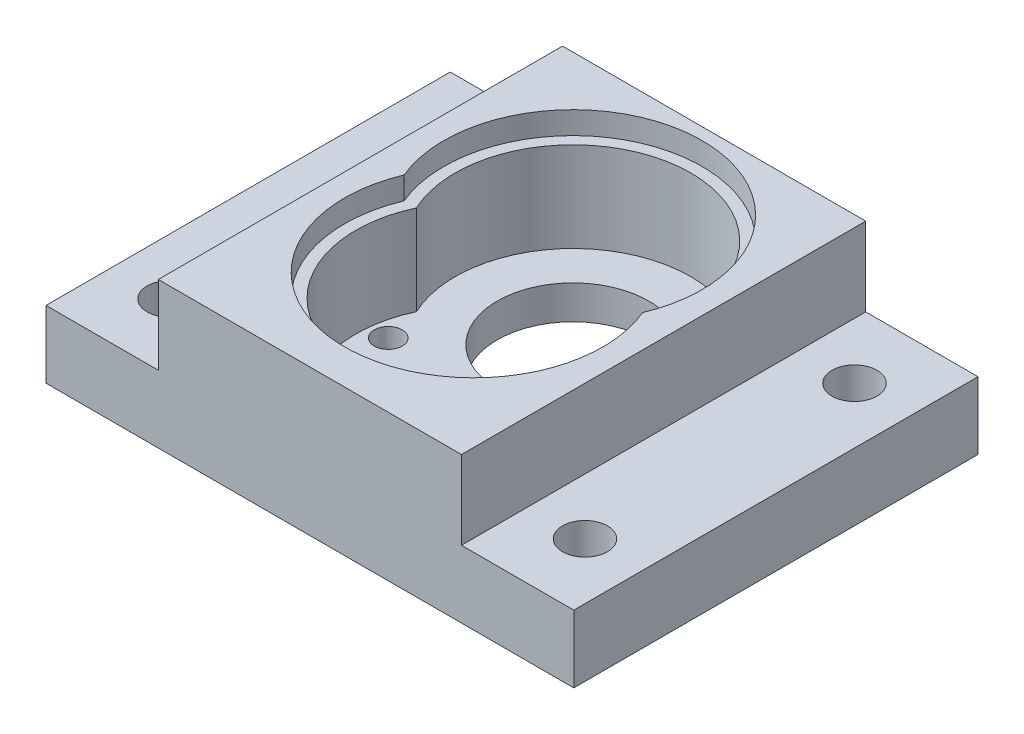
ISO-10303-21;
HEADER;
FILE_DESCRIPTION(('STEP AP214'),'2;1');
FILE_NAME('part.step','',(''),(''),'','','');
FILE_SCHEMA(('AUTOMOTIVE_DESIGN { 1 0 10303 214 1 1 1 1 }'));
ENDSEC;
DATA;
#1=APPLICATION_CONTEXT('core data for automotive mechanical design processes');
#2=APPLICATION_PROTOCOL_DEFINITION('international standard','automotive_design',2000,#1);
#3=PRODUCT_CONTEXT('',#1,'mechanical');
#4=PRODUCT('Part','Part','',(#3));
#5=PRODUCT_RELATED_PRODUCT_CATEGORY('part','',(#4));
#6=PRODUCT_DEFINITION_FORMATION('','',#4);
#7=PRODUCT_DEFINITION_CONTEXT('part definition',#1,'design');
#8=PRODUCT_DEFINITION('design','',#6,#7);
#9=PRODUCT_DEFINITION_SHAPE('','',#8);
#10=(LENGTH_UNIT() NAMED_UNIT(*) SI_UNIT(.MILLI.,.METRE.));
#11=(NAMED_UNIT(*) PLANE_ANGLE_UNIT() SI_UNIT($,.RADIAN.));
#12=(NAMED_UNIT(*) SI_UNIT($,.STERADIAN.) SOLID_ANGLE_UNIT());
#13=UNCERTAINTY_MEASURE_WITH_UNIT(LENGTH_MEASURE(1.E-05),#10,'distance_accuracy_value','');
#14=(GEOMETRIC_REPRESENTATION_CONTEXT(3) GLOBAL_UNCERTAINTY_ASSIGNED_CONTEXT((#13)) GLOBAL_UNIT_ASSIGNED_CONTEXT((#10,
#11,#12)) REPRESENTATION_CONTEXT('',''));
#15=CARTESIAN_POINT('',(0.,0.,0.));
#16=DIRECTION('',(0.,0.,1.));
#17=DIRECTION('',(1.,0.,0.));
#18=AXIS2_PLACEMENT_3D('',#15,#16,#17);
#19=CARTESIAN_POINT('',(-2.7,3.,10.7322998817629));
#20=DIRECTION('',(0.,-1.,0.));
#21=DIRECTION('',(0.,0.,-1.));
#22=AXIS2_PLACEMENT_3D('',#19,#20,#21);
#23=CYLINDRICAL_SURFACE('',#22,1.49999999999999);
#24=CARTESIAN_POINT('',(-2.7,0.,10.7322998817629));
#25=DIRECTION('',(0.,1.,0.));
#26=DIRECTION('',(0.,0.,-1.));
#27=AXIS2_PLACEMENT_3D('',#24,#25,#26);
#28=CIRCLE('',#27,1.49999999999999);
#29=CARTESIAN_POINT('',(-2.7,0.,9.2322998817629));
#30=VERTEX_POINT('',#29);
#31=EDGE_CURVE('E294',#30,#30,#28,.T.);
#32=ORIENTED_EDGE('',*,*,#31,.F.);
#33=EDGE_LOOP('',(#32));
#34=FACE_BOUND('',#33,.T.);
#35=DIRECTION('',(0.,-1.,0.));
#36=VECTOR('',#35,1.);
#37=CARTESIAN_POINT('',(-4.1997041539879,13.,10.7620899893726));
#38=LINE('',#37,#36);
#39=CARTESIAN_POINT('',(-4.1997041539879,11.,10.7620899893726));
#40=VERTEX_POINT('',#39);
#41=CARTESIAN_POINT('',(-4.1997041539879,3.,10.7620899893726));
#42=VERTEX_POINT('',#41);
#43=EDGE_CURVE('E218',#40,#42,#38,.T.);
#44=ORIENTED_EDGE('',*,*,#43,.F.);
#45=CARTESIAN_POINT('',(-2.7,11.,10.7322998817629));
#46=DIRECTION('',(0.,1.,0.));
#47=DIRECTION('',(0.,0.,1.));
#48=AXIS2_PLACEMENT_3D('',#45,#46,#47);
#49=CIRCLE('',#48,1.49999999999999);
#50=CARTESIAN_POINT('',(-1.4359648281927,11.,11.5398982252692));
#51=VERTEX_POINT('',#50);
#52=EDGE_CURVE('E179',#40,#51,#49,.T.);
#53=ORIENTED_EDGE('',*,*,#52,.T.);
#54=DIRECTION('',(0.,-1.,0.));
#55=VECTOR('',#54,1.);
#56=CARTESIAN_POINT('',(-1.4359648281927,13.,11.5398982252692));
#57=LINE('',#56,#55);
#58=CARTESIAN_POINT('',(-1.4359648281927,3.,11.5398982252692));
#59=VERTEX_POINT('',#58);
#60=EDGE_CURVE('E220',#51,#59,#57,.T.);
#61=ORIENTED_EDGE('',*,*,#60,.T.);
#62=CARTESIAN_POINT('',(-2.7,3.,10.7322998817629));
#63=DIRECTION('',(0.,1.,0.));
#64=DIRECTION('',(0.,0.,-1.));
#65=AXIS2_PLACEMENT_3D('',#62,#63,#64);
#66=CIRCLE('',#65,1.49999999999999);
#67=EDGE_CURVE('E297',#59,#42,#66,.T.);
#68=ORIENTED_EDGE('',*,*,#67,.T.);
#69=EDGE_LOOP('',(#44,#53,#61,#68));
#70=FACE_BOUND('',#69,.T.);
#71=ADVANCED_FACE('F38',(#34,#70),#23,.F.);
#72=CARTESIAN_POINT('',(2.7,3.,10.7322998817629));
#73=DIRECTION('',(0.,-1.,0.));
#74=DIRECTION('',(0.,0.,-1.));
#75=AXIS2_PLACEMENT_3D('',#72,#73,#74);
#76=CYLINDRICAL_SURFACE('',#75,1.49999999999999);
#77=CARTESIAN_POINT('',(2.7,0.,10.7322998817629));
#78=DIRECTION('',(0.,1.,0.));
#79=DIRECTION('',(0.,0.,1.));
#80=AXIS2_PLACEMENT_3D('',#77,#78,#79);
#81=CIRCLE('',#80,1.49999999999999);
#82=CARTESIAN_POINT('',(2.7,0.,12.2322998817629));
#83=VERTEX_POINT('',#82);
#84=EDGE_CURVE('E279',#83,#83,#81,.T.);
#85=ORIENTED_EDGE('',*,*,#84,.F.);
#86=EDGE_LOOP('',(#85));
#87=FACE_BOUND('',#86,.T.);
#88=DIRECTION('',(0.,-1.,0.));
#89=VECTOR('',#88,1.);
#90=CARTESIAN_POINT('',(1.43596482819271,13.,11.5398982252692));
#91=LINE('',#90,#89);
#92=CARTESIAN_POINT('',(1.43596482819271,11.,11.5398982252692));
#93=VERTEX_POINT('',#92);
#94=CARTESIAN_POINT('',(1.43596482819271,3.,11.5398982252692));
#95=VERTEX_POINT('',#94);
#96=EDGE_CURVE('E222',#93,#95,#91,.T.);
#97=ORIENTED_EDGE('',*,*,#96,.F.);
#98=CARTESIAN_POINT('',(2.7,11.,10.7322998817629));
#99=DIRECTION('',(0.,1.,0.));
#100=DIRECTION('',(0.,0.,1.));
#101=AXIS2_PLACEMENT_3D('',#98,#99,#100);
#102=CIRCLE('',#101,1.49999999999999);
#103=CARTESIAN_POINT('',(4.19970415398791,11.,10.7620899893726));
#104=VERTEX_POINT('',#103);
#105=EDGE_CURVE('E176',#93,#104,#102,.T.);
#106=ORIENTED_EDGE('',*,*,#105,.T.);
#107=DIRECTION('',(0.,-1.,0.));
#108=VECTOR('',#107,1.);
#109=CARTESIAN_POINT('',(4.19970415398791,13.,10.7620899893726));
#110=LINE('',#109,#108);
#111=CARTESIAN_POINT('',(4.19970415398791,3.,10.7620899893726));
#112=VERTEX_POINT('',#111);
#113=EDGE_CURVE('E206',#104,#112,#110,.T.);
#114=ORIENTED_EDGE('',*,*,#113,.T.);
#115=CARTESIAN_POINT('',(2.7,3.,10.7322998817629));
#116=DIRECTION('',(0.,1.,0.));
#117=DIRECTION('',(0.,0.,1.));
#118=AXIS2_PLACEMENT_3D('',#115,#116,#117);
#119=CIRCLE('',#118,1.49999999999999);
#120=EDGE_CURVE('E282',#112,#95,#119,.T.);
#121=ORIENTED_EDGE('',*,*,#120,.T.);
#122=EDGE_LOOP('',(#97,#106,#114,#121));
#123=FACE_BOUND('',#122,.T.);
#124=ADVANCED_FACE('F365',(#87,#123),#76,.F.);
#125=CARTESIAN_POINT('',(0.,13.,1.13855191759373));
#126=DIRECTION('',(0.,-1.,0.));
#127=DIRECTION('',(0.,0.,-1.));
#128=AXIS2_PLACEMENT_3D('',#125,#126,#127);
#129=CYLINDRICAL_SURFACE('',#128,10.5);
#130=ORIENTED_EDGE('',*,*,#113,.F.);
#131=CARTESIAN_POINT('',(0.,11.,1.13855191759373));
#132=DIRECTION('',(0.,1.,0.));
#133=DIRECTION('',(0.,0.,1.));
#134=AXIS2_PLACEMENT_3D('',#131,#132,#133);
#135=CIRCLE('',#134,10.5);
#136=CARTESIAN_POINT('',(9.52470471983253,11.,-3.28072404120314));
#137=VERTEX_POINT('',#136);
#138=EDGE_CURVE('E173',#104,#137,#135,.T.);
#139=ORIENTED_EDGE('',*,*,#138,.T.);
#140=DIRECTION('',(0.,-1.,0.));
#141=VECTOR('',#140,1.);
#142=CARTESIAN_POINT('',(9.52470471983253,13.,-3.28072404120314));
#143=LINE('',#142,#141);
#144=CARTESIAN_POINT('',(9.52470471983253,3.,-3.28072404120314));
#145=VERTEX_POINT('',#144);
#146=EDGE_CURVE('E196',#137,#145,#143,.T.);
#147=ORIENTED_EDGE('',*,*,#146,.T.);
#148=CARTESIAN_POINT('',(0.,3.,1.13855191759373));
#149=DIRECTION('',(0.,1.,0.));
#150=DIRECTION('',(0.,0.,1.));
#151=AXIS2_PLACEMENT_3D('',#148,#149,#150);
#152=CIRCLE('',#151,10.5);
#153=EDGE_CURVE('E185',#112,#145,#152,.T.);
#154=ORIENTED_EDGE('',*,*,#153,.F.);
#155=EDGE_LOOP('',(#130,#139,#147,#154));
#156=FACE_BOUND('',#155,.T.);
#157=ADVANCED_FACE('F371',(#156),#129,.F.);
#158=ORIENTED_EDGE('',*,*,#60,.F.);
#159=CARTESIAN_POINT('',(0.,11.,1.13855191759373));
#160=DIRECTION('',(0.,1.,0.));
#161=DIRECTION('',(0.,0.,1.));
#162=AXIS2_PLACEMENT_3D('',#159,#160,#161);
#163=CIRCLE('',#162,10.5);
#164=EDGE_CURVE('E182',#51,#93,#163,.T.);
#165=ORIENTED_EDGE('',*,*,#164,.T.);
#166=ORIENTED_EDGE('',*,*,#96,.T.);
#167=EDGE_CURVE('E199',#59,#95,#152,.T.);
#168=ORIENTED_EDGE('',*,*,#167,.F.);
#169=EDGE_LOOP('',(#158,#165,#166,#168));
#170=FACE_BOUND('',#169,.T.);
#171=ADVANCED_FACE('F496',(#170),#129,.F.);
#172=DIRECTION('',(0.,-1.,0.));
#173=VECTOR('',#172,1.);
#174=CARTESIAN_POINT('',(-9.52470471983253,13.,-3.28072404120314));
#175=LINE('',#174,#173);
#176=CARTESIAN_POINT('',(-9.52470471983253,11.,-3.28072404120314));
#177=VERTEX_POINT('',#176);
#178=CARTESIAN_POINT('',(-9.52470471983253,3.,-3.28072404120314));
#179=VERTEX_POINT('',#178);
#180=EDGE_CURVE('E216',#177,#179,#175,.T.);
#181=ORIENTED_EDGE('',*,*,#180,.F.);
#182=CARTESIAN_POINT('',(0.,11.,1.13855191759373));
#183=DIRECTION('',(0.,1.,0.));
#184=DIRECTION('',(0.,0.,1.));
#185=AXIS2_PLACEMENT_3D('',#182,#183,#184);
#186=CIRCLE('',#185,10.5);
#187=EDGE_CURVE('E53',#177,#40,#186,.T.);
#188=ORIENTED_EDGE('',*,*,#187,.T.);
#189=ORIENTED_EDGE('',*,*,#43,.T.);
#190=EDGE_CURVE('E200',#179,#42,#152,.T.);
#191=ORIENTED_EDGE('',*,*,#190,.F.);
#192=EDGE_LOOP('',(#181,#188,#189,#191));
#193=FACE_BOUND('',#192,.T.);
#194=ADVANCED_FACE('F493',(#193),#129,.F.);
#195=CARTESIAN_POINT('',(0.,13.,-7.7));
#196=DIRECTION('',(0.,-1.,0.));
#197=DIRECTION('',(0.,0.,-1.));
#198=AXIS2_PLACEMENT_3D('',#195,#196,#197);
#199=CYLINDRICAL_SURFACE('',#198,10.5);
#200=ORIENTED_EDGE('',*,*,#146,.F.);
#201=CARTESIAN_POINT('',(0.,11.,-7.7));
#202=DIRECTION('',(0.,1.,0.));
#203=DIRECTION('',(0.,0.,1.));
#204=AXIS2_PLACEMENT_3D('',#201,#202,#203);
#205=CIRCLE('',#204,10.5);
#206=EDGE_CURVE('E11',#137,#177,#205,.T.);
#207=ORIENTED_EDGE('',*,*,#206,.T.);
#208=ORIENTED_EDGE('',*,*,#180,.T.);
#209=CARTESIAN_POINT('',(0.,3.,-7.7));
#210=DIRECTION('',(0.,1.,0.));
#211=DIRECTION('',(0.,0.,1.));
#212=AXIS2_PLACEMENT_3D('',#209,#210,#211);
#213=CIRCLE('',#212,10.5);
#214=EDGE_CURVE('E190',#145,#179,#213,.T.);
#215=ORIENTED_EDGE('',*,*,#214,.F.);
#216=EDGE_LOOP('',(#200,#207,#208,#215));
#217=FACE_BOUND('',#216,.T.);
#218=ADVANCED_FACE('F490',(#217),#199,.F.);
#219=CARTESIAN_POINT('',(8.75,3.,0.));
#220=DIRECTION('',(0.,-1.,0.));
#221=DIRECTION('',(0.,0.,-1.));
#222=AXIS2_PLACEMENT_3D('',#219,#220,#221);
#223=CYLINDRICAL_SURFACE('',#222,1.25);
#224=CARTESIAN_POINT('',(8.75,3.,0.));
#225=DIRECTION('',(0.,1.,0.));
#226=DIRECTION('',(0.,0.,1.));
#227=AXIS2_PLACEMENT_3D('',#224,#225,#226);
#228=CIRCLE('',#227,1.25);
#229=CARTESIAN_POINT('',(8.75,3.,1.25));
#230=VERTEX_POINT('',#229);
#231=EDGE_CURVE('E285',#230,#230,#228,.T.);
#232=ORIENTED_EDGE('',*,*,#231,.T.);
#233=EDGE_LOOP('',(#232));
#234=FACE_BOUND('',#233,.T.);
#235=CARTESIAN_POINT('',(8.75,1.,0.));
#236=DIRECTION('',(0.,-1.,0.));
#237=DIRECTION('',(0.,0.,-1.));
#238=AXIS2_PLACEMENT_3D('',#235,#236,#237);
#239=CIRCLE('',#238,1.25);
#240=CARTESIAN_POINT('',(8.75,1.,-1.25));
#241=VERTEX_POINT('',#240);
#242=EDGE_CURVE('E228',#241,#241,#239,.T.);
#243=ORIENTED_EDGE('',*,*,#242,.T.);
#244=EDGE_LOOP('',(#243));
#245=FACE_BOUND('',#244,.T.);
#246=ADVANCED_FACE('F312',(#234,#245),#223,.F.);
#247=CARTESIAN_POINT('',(-8.75,3.,0.));
#248=DIRECTION('',(0.,-1.,0.));
#249=DIRECTION('',(0.,0.,-1.));
#250=AXIS2_PLACEMENT_3D('',#247,#248,#249);
#251=CYLINDRICAL_SURFACE('',#250,1.25000000000004);
#252=CARTESIAN_POINT('',(-8.75,3.,0.));
#253=DIRECTION('',(0.,1.,0.));
#254=DIRECTION('',(0.,0.,-1.));
#255=AXIS2_PLACEMENT_3D('',#252,#253,#254);
#256=CIRCLE('',#255,1.25000000000004);
#257=CARTESIAN_POINT('',(-8.75,3.,-1.25000000000004));
#258=VERTEX_POINT('',#257);
#259=EDGE_CURVE('E300',#258,#258,#256,.T.);
#260=ORIENTED_EDGE('',*,*,#259,.T.);
#261=EDGE_LOOP('',(#260));
#262=FACE_BOUND('',#261,.T.);
#263=CARTESIAN_POINT('',(-8.75,1.,0.));
#264=DIRECTION('',(0.,-1.,0.));
#265=DIRECTION('',(0.,0.,-1.));
#266=AXIS2_PLACEMENT_3D('',#263,#264,#265);
#267=CIRCLE('',#266,1.25000000000004);
#268=CARTESIAN_POINT('',(-8.75,1.,-1.25000000000004));
#269=VERTEX_POINT('',#268);
#270=EDGE_CURVE('E234',#269,#269,#267,.T.);
#271=ORIENTED_EDGE('',*,*,#270,.T.);
#272=EDGE_LOOP('',(#271));
#273=FACE_BOUND('',#272,.T.);
#274=ADVANCED_FACE('F376',(#262,#273),#251,.F.);
#275=CARTESIAN_POINT('',(0.,3.,0.));
#276=DIRECTION('',(0.,-1.,0.));
#277=DIRECTION('',(0.,0.,-1.));
#278=AXIS2_PLACEMENT_3D('',#275,#276,#277);
#279=PLANE('',#278);
#280=ORIENTED_EDGE('',*,*,#67,.F.);
#281=ORIENTED_EDGE('',*,*,#167,.T.);
#282=ORIENTED_EDGE('',*,*,#120,.F.);
#283=ORIENTED_EDGE('',*,*,#153,.T.);
#284=ORIENTED_EDGE('',*,*,#214,.T.);
#285=ORIENTED_EDGE('',*,*,#190,.T.);
#286=EDGE_LOOP('',(#280,#281,#282,#283,#284,#285));
#287=FACE_BOUND('',#286,.T.);
#288=CARTESIAN_POINT('',(0.,3.,-7.7));
#289=DIRECTION('',(0.,1.,0.));
#290=DIRECTION('',(0.,0.,1.));
#291=AXIS2_PLACEMENT_3D('',#288,#289,#290);
#292=CIRCLE('',#291,6.75);
#293=CARTESIAN_POINT('',(0.,3.,-0.950000000000003));
#294=VERTEX_POINT('',#293);
#295=EDGE_CURVE('E291',#294,#294,#292,.T.);
#296=ORIENTED_EDGE('',*,*,#295,.F.);
#297=EDGE_LOOP('',(#296));
#298=FACE_BOUND('',#297,.T.);
#299=ORIENTED_EDGE('',*,*,#259,.F.);
#300=EDGE_LOOP('',(#299));
#301=FACE_BOUND('',#300,.T.);
#302=ORIENTED_EDGE('',*,*,#231,.F.);
#303=EDGE_LOOP('',(#302));
#304=FACE_BOUND('',#303,.T.);
#305=CARTESIAN_POINT('',(0.,3.,4.3));
#306=DIRECTION('',(0.,1.,0.));
#307=DIRECTION('',(0.,0.,1.));
#308=AXIS2_PLACEMENT_3D('',#305,#306,#307);
#309=CIRCLE('',#308,1.5);
#310=CARTESIAN_POINT('',(0.,3.,5.8));
#311=VERTEX_POINT('',#310);
#312=EDGE_CURVE('E276',#311,#311,#309,.T.);
#313=ORIENTED_EDGE('',*,*,#312,.F.);
#314=EDGE_LOOP('',(#313));
#315=FACE_BOUND('',#314,.T.);
#316=ADVANCED_FACE('F331',(#287,#298,#301,#304,#315),#279,.F.);
#317=CARTESIAN_POINT('',(0.,0.,0.));
#318=DIRECTION('',(0.,-1.,0.));
#319=DIRECTION('',(0.,0.,-1.));
#320=AXIS2_PLACEMENT_3D('',#317,#318,#319);
#321=PLANE('',#320);
#322=CARTESIAN_POINT('',(18.5,0.,-14.2677001182371));
#323=DIRECTION('',(0.,-1.,0.));
#324=DIRECTION('',(0.,0.,-1.));
#325=AXIS2_PLACEMENT_3D('',#322,#323,#324);
#326=CIRCLE('',#325,2.);
#327=CARTESIAN_POINT('',(18.5,0.,-16.2677001182371));
#328=VERTEX_POINT('',#327);
#329=EDGE_CURVE('E442',#328,#328,#326,.T.);
#330=ORIENTED_EDGE('',*,*,#329,.F.);
#331=EDGE_LOOP('',(#330));
#332=FACE_BOUND('',#331,.T.);
#333=CARTESIAN_POINT('',(18.5,0.,9.7322998817629));
#334=DIRECTION('',(0.,-1.,0.));
#335=DIRECTION('',(0.,0.,-1.));
#336=AXIS2_PLACEMENT_3D('',#333,#334,#335);
#337=CIRCLE('',#336,2.);
#338=CARTESIAN_POINT('',(18.5,0.,7.7322998817629));
#339=VERTEX_POINT('',#338);
#340=EDGE_CURVE('E441',#339,#339,#337,.T.);
#341=ORIENTED_EDGE('',*,*,#340,.F.);
#342=EDGE_LOOP('',(#341));
#343=FACE_BOUND('',#342,.T.);
#344=CARTESIAN_POINT('',(-18.5,0.,9.7322998817629));
#345=DIRECTION('',(0.,-1.,0.));
#346=DIRECTION('',(0.,0.,-1.));
#347=AXIS2_PLACEMENT_3D('',#344,#345,#346);
#348=CIRCLE('',#347,2.);
#349=CARTESIAN_POINT('',(-18.5,0.,7.7322998817629));
#350=VERTEX_POINT('',#349);
#351=EDGE_CURVE('E453',#350,#350,#348,.T.);
#352=ORIENTED_EDGE('',*,*,#351,.F.);
#353=EDGE_LOOP('',(#352));
#354=FACE_BOUND('',#353,.T.);
#355=CARTESIAN_POINT('',(-18.5,0.,-14.2677001182371));
#356=DIRECTION('',(0.,-1.,0.));
#357=DIRECTION('',(0.,0.,-1.));
#358=AXIS2_PLACEMENT_3D('',#355,#356,#357);
#359=CIRCLE('',#358,2.);
#360=CARTESIAN_POINT('',(-18.5,0.,-16.2677001182371));
#361=VERTEX_POINT('',#360);
#362=EDGE_CURVE('E169',#361,#361,#359,.T.);
#363=ORIENTED_EDGE('',*,*,#362,.F.);
#364=EDGE_LOOP('',(#363));
#365=FACE_BOUND('',#364,.T.);
#366=CARTESIAN_POINT('',(8.75,0.,0.));
#367=DIRECTION('',(0.,-1.,0.));
#368=DIRECTION('',(0.,0.,-1.));
#369=AXIS2_PLACEMENT_3D('',#366,#367,#368);
#370=CIRCLE('',#369,3.);
#371=CARTESIAN_POINT('',(8.75,0.,-3.));
#372=VERTEX_POINT('',#371);
#373=EDGE_CURVE('E214',#372,#372,#370,.T.);
#374=ORIENTED_EDGE('',*,*,#373,.F.);
#375=EDGE_LOOP('',(#374));
#376=FACE_BOUND('',#375,.T.);
#377=CARTESIAN_POINT('',(-8.75,0.,0.));
#378=DIRECTION('',(0.,-1.,0.));
#379=DIRECTION('',(0.,0.,-1.));
#380=AXIS2_PLACEMENT_3D('',#377,#378,#379);
#381=CIRCLE('',#380,3.);
#382=CARTESIAN_POINT('',(-8.75,0.,-3.));
#383=VERTEX_POINT('',#382);
#384=EDGE_CURVE('E235',#383,#383,#381,.T.);
#385=ORIENTED_EDGE('',*,*,#384,.F.);
#386=EDGE_LOOP('',(#385));
#387=FACE_BOUND('',#386,.T.);
#388=ORIENTED_EDGE('',*,*,#84,.T.);
#389=EDGE_LOOP('',(#388));
#390=FACE_BOUND('',#389,.T.);
#391=CARTESIAN_POINT('',(0.,0.,-7.7));
#392=DIRECTION('',(0.,1.,0.));
#393=DIRECTION('',(0.,0.,1.));
#394=AXIS2_PLACEMENT_3D('',#391,#392,#393);
#395=CIRCLE('',#394,6.75);
#396=CARTESIAN_POINT('',(0.,0.,-0.950000000000003));
#397=VERTEX_POINT('',#396);
#398=EDGE_CURVE('E290',#397,#397,#395,.T.);
#399=ORIENTED_EDGE('',*,*,#398,.T.);
#400=EDGE_LOOP('',(#399));
#401=FACE_BOUND('',#400,.T.);
#402=DIRECTION('',(-1.,0.,0.));
#403=VECTOR('',#402,1.);
#404=CARTESIAN_POINT('',(-13.5,0.,-20.2677001182371));
#405=LINE('',#404,#403);
#406=CARTESIAN_POINT('',(23.5,0.,-20.2677001182371));
#407=VERTEX_POINT('',#406);
#408=CARTESIAN_POINT('',(-23.5,0.,-20.2677001182371));
#409=VERTEX_POINT('',#408);
#410=EDGE_CURVE('E305',#407,#409,#405,.T.);
#411=ORIENTED_EDGE('',*,*,#410,.F.);
#412=DIRECTION('',(0.,0.,-1.));
#413=VECTOR('',#412,1.);
#414=CARTESIAN_POINT('',(23.5,0.,27.3942036714535));
#415=LINE('',#414,#413);
#416=CARTESIAN_POINT('',(23.5,0.,15.7322998817629));
#417=VERTEX_POINT('',#416);
#418=EDGE_CURVE('E261',#417,#407,#415,.T.);
#419=ORIENTED_EDGE('',*,*,#418,.F.);
#420=DIRECTION('',(1.,0.,0.));
#421=VECTOR('',#420,1.);
#422=CARTESIAN_POINT('',(-13.5,0.,15.7322998817629));
#423=LINE('',#422,#421);
#424=CARTESIAN_POINT('',(-23.5,0.,15.7322998817629));
#425=VERTEX_POINT('',#424);
#426=EDGE_CURVE('E46',#425,#417,#423,.T.);
#427=ORIENTED_EDGE('',*,*,#426,.F.);
#428=DIRECTION('',(0.,0.,-1.));
#429=VECTOR('',#428,1.);
#430=CARTESIAN_POINT('',(-23.5,0.,27.3942036714535));
#431=LINE('',#430,#429);
#432=EDGE_CURVE('E251',#425,#409,#431,.T.);
#433=ORIENTED_EDGE('',*,*,#432,.T.);
#434=EDGE_LOOP('',(#411,#419,#427,#433));
#435=FACE_BOUND('',#434,.T.);
#436=ORIENTED_EDGE('',*,*,#31,.T.);
#437=EDGE_LOOP('',(#436));
#438=FACE_BOUND('',#437,.T.);
#439=CARTESIAN_POINT('',(0.,0.,4.3));
#440=DIRECTION('',(0.,1.,0.));
#441=DIRECTION('',(0.,0.,1.));
#442=AXIS2_PLACEMENT_3D('',#439,#440,#441);
#443=CIRCLE('',#442,1.5);
#444=CARTESIAN_POINT('',(0.,0.,5.8));
#445=VERTEX_POINT('',#444);
#446=EDGE_CURVE('E275',#445,#445,#443,.T.);
#447=ORIENTED_EDGE('',*,*,#446,.T.);
#448=EDGE_LOOP('',(#447));
#449=FACE_BOUND('',#448,.T.);
#450=ADVANCED_FACE('F328',(#332,#343,#354,#365,#376,#387,#390,#401,#435,#438,#449),#321,.T.);
#451=CARTESIAN_POINT('',(-13.5,3.,-20.2677001182371));
#452=DIRECTION('',(0.,0.,1.));
#453=DIRECTION('',(1.,0.,0.));
#454=AXIS2_PLACEMENT_3D('',#451,#452,#453);
#455=PLANE('',#454);
#456=DIRECTION('',(0.,-1.,0.));
#457=VECTOR('',#456,1.);
#458=CARTESIAN_POINT('',(13.5,13.,-20.2677001182371));
#459=LINE('',#458,#457);
#460=CARTESIAN_POINT('',(13.5,13.,-20.2677001182371));
#461=VERTEX_POINT('',#460);
#462=CARTESIAN_POINT('',(13.5,6.,-20.2677001182371));
#463=VERTEX_POINT('',#462);
#464=EDGE_CURVE('E211',#461,#463,#459,.T.);
#465=ORIENTED_EDGE('',*,*,#464,.T.);
#466=DIRECTION('',(1.,0.,0.));
#467=VECTOR('',#466,1.);
#468=CARTESIAN_POINT('',(13.5,6.,-20.2677001182371));
#469=LINE('',#468,#467);
#470=CARTESIAN_POINT('',(23.5,6.,-20.2677001182371));
#471=VERTEX_POINT('',#470);
#472=EDGE_CURVE('E244',#463,#471,#469,.T.);
#473=ORIENTED_EDGE('',*,*,#472,.T.);
#474=DIRECTION('',(0.,-1.,0.));
#475=VECTOR('',#474,1.);
#476=CARTESIAN_POINT('',(23.5,0.,-20.2677001182371));
#477=LINE('',#476,#475);
#478=EDGE_CURVE('E264',#471,#407,#477,.T.);
#479=ORIENTED_EDGE('',*,*,#478,.T.);
#480=ORIENTED_EDGE('',*,*,#410,.T.);
#481=DIRECTION('',(0.,1.,0.));
#482=VECTOR('',#481,1.);
#483=CARTESIAN_POINT('',(-23.5,0.,-20.2677001182371));
#484=LINE('',#483,#482);
#485=CARTESIAN_POINT('',(-23.5,6.,-20.2677001182371));
#486=VERTEX_POINT('',#485);
#487=EDGE_CURVE('E245',#409,#486,#484,.T.);
#488=ORIENTED_EDGE('',*,*,#487,.T.);
#489=DIRECTION('',(1.,0.,0.));
#490=VECTOR('',#489,1.);
#491=CARTESIAN_POINT('',(-13.5,6.,-20.2677001182371));
#492=LINE('',#491,#490);
#493=CARTESIAN_POINT('',(-13.5,6.,-20.2677001182371));
#494=VERTEX_POINT('',#493);
#495=EDGE_CURVE('E248',#486,#494,#492,.T.);
#496=ORIENTED_EDGE('',*,*,#495,.T.);
#497=DIRECTION('',(0.,-1.,0.));
#498=VECTOR('',#497,1.);
#499=CARTESIAN_POINT('',(-13.5,13.,-20.2677001182371));
#500=LINE('',#499,#498);
#501=CARTESIAN_POINT('',(-13.5,13.,-20.2677001182371));
#502=VERTEX_POINT('',#501);
#503=EDGE_CURVE('E209',#502,#494,#500,.T.);
#504=ORIENTED_EDGE('',*,*,#503,.F.);
#505=DIRECTION('',(-1.,0.,0.));
#506=VECTOR('',#505,1.);
#507=CARTESIAN_POINT('',(0.,13.,-20.2677001182371));
#508=LINE('',#507,#506);
#509=EDGE_CURVE('E189',#461,#502,#508,.T.);
#510=ORIENTED_EDGE('',*,*,#509,.F.);
#511=EDGE_LOOP('',(#465,#473,#479,#480,#488,#496,#504,#510));
#512=FACE_BOUND('',#511,.T.);
#513=ADVANCED_FACE('F40',(#512),#455,.F.);
#514=CARTESIAN_POINT('',(-13.5,3.,15.7322998817629));
#515=DIRECTION('',(0.,0.,-1.));
#516=DIRECTION('',(-1.,0.,0.));
#517=AXIS2_PLACEMENT_3D('',#514,#515,#516);
#518=PLANE('',#517);
#519=ORIENTED_EDGE('',*,*,#426,.T.);
#520=DIRECTION('',(0.,1.,0.));
#521=VECTOR('',#520,1.);
#522=CARTESIAN_POINT('',(23.5,0.,15.7322998817629));
#523=LINE('',#522,#521);
#524=CARTESIAN_POINT('',(23.5,6.,15.7322998817629));
#525=VERTEX_POINT('',#524);
#526=EDGE_CURVE('E258',#417,#525,#523,.T.);
#527=ORIENTED_EDGE('',*,*,#526,.T.);
#528=DIRECTION('',(-1.,0.,0.));
#529=VECTOR('',#528,1.);
#530=CARTESIAN_POINT('',(13.5,6.,15.7322998817629));
#531=LINE('',#530,#529);
#532=CARTESIAN_POINT('',(13.5,6.,15.7322998817629));
#533=VERTEX_POINT('',#532);
#534=EDGE_CURVE('E260',#525,#533,#531,.T.);
#535=ORIENTED_EDGE('',*,*,#534,.T.);
#536=DIRECTION('',(0.,-1.,0.));
#537=VECTOR('',#536,1.);
#538=CARTESIAN_POINT('',(13.5,13.,15.7322998817629));
#539=LINE('',#538,#537);
#540=CARTESIAN_POINT('',(13.5,13.,15.7322998817629));
#541=VERTEX_POINT('',#540);
#542=EDGE_CURVE('E203',#541,#533,#539,.T.);
#543=ORIENTED_EDGE('',*,*,#542,.F.);
#544=DIRECTION('',(1.,0.,0.));
#545=VECTOR('',#544,1.);
#546=CARTESIAN_POINT('',(0.,13.,15.7322998817629));
#547=LINE('',#546,#545);
#548=CARTESIAN_POINT('',(-13.5,13.,15.7322998817629));
#549=VERTEX_POINT('',#548);
#550=EDGE_CURVE('E194',#549,#541,#547,.T.);
#551=ORIENTED_EDGE('',*,*,#550,.F.);
#552=DIRECTION('',(0.,-1.,0.));
#553=VECTOR('',#552,1.);
#554=CARTESIAN_POINT('',(-13.5,13.,15.7322998817629));
#555=LINE('',#554,#553);
#556=CARTESIAN_POINT('',(-13.5,6.,15.7322998817629));
#557=VERTEX_POINT('',#556);
#558=EDGE_CURVE('E205',#549,#557,#555,.T.);
#559=ORIENTED_EDGE('',*,*,#558,.T.);
#560=DIRECTION('',(-1.,0.,0.));
#561=VECTOR('',#560,1.);
#562=CARTESIAN_POINT('',(-13.5,6.,15.7322998817629));
#563=LINE('',#562,#561);
#564=CARTESIAN_POINT('',(-23.5,6.,15.7322998817629));
#565=VERTEX_POINT('',#564);
#566=EDGE_CURVE('E241',#557,#565,#563,.T.);
#567=ORIENTED_EDGE('',*,*,#566,.T.);
#568=DIRECTION('',(0.,-1.,0.));
#569=VECTOR('',#568,1.);
#570=CARTESIAN_POINT('',(-23.5,0.,15.7322998817629));
#571=LINE('',#570,#569);
#572=EDGE_CURVE('E238',#565,#425,#571,.T.);
#573=ORIENTED_EDGE('',*,*,#572,.T.);
#574=EDGE_LOOP('',(#519,#527,#535,#543,#551,#559,#567,#573));
#575=FACE_BOUND('',#574,.T.);
#576=ADVANCED_FACE('F359',(#575),#518,.F.);
#577=CARTESIAN_POINT('',(0.,3.,-7.7));
#578=DIRECTION('',(0.,-1.,0.));
#579=DIRECTION('',(0.,0.,-1.));
#580=AXIS2_PLACEMENT_3D('',#577,#578,#579);
#581=CYLINDRICAL_SURFACE('',#580,6.75);
#582=ORIENTED_EDGE('',*,*,#295,.T.);
#583=EDGE_LOOP('',(#582));
#584=FACE_BOUND('',#583,.T.);
#585=ORIENTED_EDGE('',*,*,#398,.F.);
#586=EDGE_LOOP('',(#585));
#587=FACE_BOUND('',#586,.T.);
#588=ADVANCED_FACE('F349',(#584,#587),#581,.F.);
#589=CARTESIAN_POINT('',(0.,3.,4.3));
#590=DIRECTION('',(0.,-1.,0.));
#591=DIRECTION('',(0.,0.,-1.));
#592=AXIS2_PLACEMENT_3D('',#589,#590,#591);
#593=CYLINDRICAL_SURFACE('',#592,1.5);
#594=ORIENTED_EDGE('',*,*,#312,.T.);
#595=EDGE_LOOP('',(#594));
#596=FACE_BOUND('',#595,.T.);
#597=ORIENTED_EDGE('',*,*,#446,.F.);
#598=EDGE_LOOP('',(#597));
#599=FACE_BOUND('',#598,.T.);
#600=ADVANCED_FACE('F346',(#596,#599),#593,.F.);
#601=CARTESIAN_POINT('',(23.5,0.,27.3942036714535));
#602=DIRECTION('',(1.,0.,0.));
#603=DIRECTION('',(0.,0.,-1.));
#604=AXIS2_PLACEMENT_3D('',#601,#602,#603);
#605=PLANE('',#604);
#606=ORIENTED_EDGE('',*,*,#526,.F.);
#607=ORIENTED_EDGE('',*,*,#418,.T.);
#608=ORIENTED_EDGE('',*,*,#478,.F.);
#609=DIRECTION('',(0.,0.,-1.));
#610=VECTOR('',#609,1.);
#611=CARTESIAN_POINT('',(23.5,6.,27.3942036714535));
#612=LINE('',#611,#610);
#613=EDGE_CURVE('E270',#525,#471,#612,.T.);
#614=ORIENTED_EDGE('',*,*,#613,.F.);
#615=EDGE_LOOP('',(#606,#607,#608,#614));
#616=FACE_BOUND('',#615,.T.);
#617=ADVANCED_FACE('F348',(#616),#605,.T.);
#618=CARTESIAN_POINT('',(13.5,6.,27.3942036714535));
#619=DIRECTION('',(0.,1.,0.));
#620=DIRECTION('',(-1.,0.,0.));
#621=AXIS2_PLACEMENT_3D('',#618,#619,#620);
#622=PLANE('',#621);
#623=CARTESIAN_POINT('',(18.5,6.,-14.2677001182371));
#624=DIRECTION('',(0.,1.,0.));
#625=DIRECTION('',(1.,0.,0.));
#626=AXIS2_PLACEMENT_3D('',#623,#624,#625);
#627=CIRCLE('',#626,2.);
#628=CARTESIAN_POINT('',(20.5,6.,-14.2677001182371));
#629=VERTEX_POINT('',#628);
#630=EDGE_CURVE('E436',#629,#629,#627,.T.);
#631=ORIENTED_EDGE('',*,*,#630,.F.);
#632=EDGE_LOOP('',(#631));
#633=FACE_BOUND('',#632,.T.);
#634=CARTESIAN_POINT('',(18.5,6.,9.7322998817629));
#635=DIRECTION('',(0.,1.,0.));
#636=DIRECTION('',(1.,0.,0.));
#637=AXIS2_PLACEMENT_3D('',#634,#635,#636);
#638=CIRCLE('',#637,2.);
#639=CARTESIAN_POINT('',(20.5,6.,9.7322998817629));
#640=VERTEX_POINT('',#639);
#641=EDGE_CURVE('E439',#640,#640,#638,.T.);
#642=ORIENTED_EDGE('',*,*,#641,.F.);
#643=EDGE_LOOP('',(#642));
#644=FACE_BOUND('',#643,.T.);
#645=ORIENTED_EDGE('',*,*,#534,.F.);
#646=ORIENTED_EDGE('',*,*,#613,.T.);
#647=ORIENTED_EDGE('',*,*,#472,.F.);
#648=DIRECTION('',(0.,0.,-1.));
#649=VECTOR('',#648,1.);
#650=CARTESIAN_POINT('',(13.5,6.,27.3942036714535));
#651=LINE('',#650,#649);
#652=EDGE_CURVE('E267',#533,#463,#651,.T.);
#653=ORIENTED_EDGE('',*,*,#652,.F.);
#654=EDGE_LOOP('',(#645,#646,#647,#653));
#655=FACE_BOUND('',#654,.T.);
#656=ADVANCED_FACE('F356',(#633,#644,#655),#622,.T.);
#657=CARTESIAN_POINT('',(-13.5,6.,27.3942036714535));
#658=DIRECTION('',(0.,1.,0.));
#659=DIRECTION('',(-1.,0.,0.));
#660=AXIS2_PLACEMENT_3D('',#657,#658,#659);
#661=PLANE('',#660);
#662=CARTESIAN_POINT('',(-18.5,6.,9.7322998817629));
#663=DIRECTION('',(0.,1.,0.));
#664=DIRECTION('',(-1.,0.,0.));
#665=AXIS2_PLACEMENT_3D('',#662,#663,#664);
#666=CIRCLE('',#665,2.);
#667=CARTESIAN_POINT('',(-20.5,6.,9.7322998817629));
#668=VERTEX_POINT('',#667);
#669=EDGE_CURVE('E445',#668,#668,#666,.T.);
#670=ORIENTED_EDGE('',*,*,#669,.F.);
#671=EDGE_LOOP('',(#670));
#672=FACE_BOUND('',#671,.T.);
#673=CARTESIAN_POINT('',(-18.5,6.,-14.2677001182371));
#674=DIRECTION('',(0.,1.,0.));
#675=DIRECTION('',(-1.,0.,0.));
#676=AXIS2_PLACEMENT_3D('',#673,#674,#675);
#677=CIRCLE('',#676,2.);
#678=CARTESIAN_POINT('',(-20.5,6.,-14.2677001182371));
#679=VERTEX_POINT('',#678);
#680=EDGE_CURVE('E456',#679,#679,#677,.T.);
#681=ORIENTED_EDGE('',*,*,#680,.F.);
#682=EDGE_LOOP('',(#681));
#683=FACE_BOUND('',#682,.T.);
#684=ORIENTED_EDGE('',*,*,#566,.F.);
#685=DIRECTION('',(0.,0.,-1.));
#686=VECTOR('',#685,1.);
#687=CARTESIAN_POINT('',(-13.5,6.,27.3942036714535));
#688=LINE('',#687,#686);
#689=EDGE_CURVE('E242',#557,#494,#688,.T.);
#690=ORIENTED_EDGE('',*,*,#689,.T.);
#691=ORIENTED_EDGE('',*,*,#495,.F.);
#692=DIRECTION('',(0.,0.,-1.));
#693=VECTOR('',#692,1.);
#694=CARTESIAN_POINT('',(-23.5,6.,27.3942036714535));
#695=LINE('',#694,#693);
#696=EDGE_CURVE('E254',#565,#486,#695,.T.);
#697=ORIENTED_EDGE('',*,*,#696,.F.);
#698=EDGE_LOOP('',(#684,#690,#691,#697));
#699=FACE_BOUND('',#698,.T.);
#700=ADVANCED_FACE('F412',(#672,#683,#699),#661,.T.);
#701=CARTESIAN_POINT('',(-23.5,0.,27.3942036714535));
#702=DIRECTION('',(-1.,0.,0.));
#703=DIRECTION('',(0.,0.,1.));
#704=AXIS2_PLACEMENT_3D('',#701,#702,#703);
#705=PLANE('',#704);
#706=ORIENTED_EDGE('',*,*,#572,.F.);
#707=ORIENTED_EDGE('',*,*,#696,.T.);
#708=ORIENTED_EDGE('',*,*,#487,.F.);
#709=ORIENTED_EDGE('',*,*,#432,.F.);
#710=EDGE_LOOP('',(#706,#707,#708,#709));
#711=FACE_BOUND('',#710,.T.);
#712=ADVANCED_FACE('F416',(#711),#705,.T.);
#713=CARTESIAN_POINT('',(-8.75,1.,0.));
#714=DIRECTION('',(0.,-1.,0.));
#715=DIRECTION('',(0.,0.,-1.));
#716=AXIS2_PLACEMENT_3D('',#713,#714,#715);
#717=CYLINDRICAL_SURFACE('',#716,3.);
#718=CARTESIAN_POINT('',(-8.75,1.,0.));
#719=DIRECTION('',(0.,-1.,0.));
#720=DIRECTION('',(0.,0.,-1.));
#721=AXIS2_PLACEMENT_3D('',#718,#719,#720);
#722=CIRCLE('',#721,3.);
#723=CARTESIAN_POINT('',(-8.75,1.,-3.));
#724=VERTEX_POINT('',#723);
#725=EDGE_CURVE('E231',#724,#724,#722,.T.);
#726=ORIENTED_EDGE('',*,*,#725,.F.);
#727=EDGE_LOOP('',(#726));
#728=FACE_BOUND('',#727,.T.);
#729=ORIENTED_EDGE('',*,*,#384,.T.);
#730=EDGE_LOOP('',(#729));
#731=FACE_BOUND('',#730,.T.);
#732=ADVANCED_FACE('F418',(#728,#731),#717,.F.);
#733=CARTESIAN_POINT('',(-8.75,1.,0.));
#734=DIRECTION('',(0.,-1.,0.));
#735=DIRECTION('',(0.,0.,-1.));
#736=AXIS2_PLACEMENT_3D('',#733,#734,#735);
#737=PLANE('',#736);
#738=ORIENTED_EDGE('',*,*,#270,.F.);
#739=EDGE_LOOP('',(#738));
#740=FACE_BOUND('',#739,.T.);
#741=ORIENTED_EDGE('',*,*,#725,.T.);
#742=EDGE_LOOP('',(#741));
#743=FACE_BOUND('',#742,.T.);
#744=ADVANCED_FACE('F324',(#740,#743),#737,.T.);
#745=CARTESIAN_POINT('',(8.75,1.,0.));
#746=DIRECTION('',(0.,-1.,0.));
#747=DIRECTION('',(0.,0.,-1.));
#748=AXIS2_PLACEMENT_3D('',#745,#746,#747);
#749=CYLINDRICAL_SURFACE('',#748,3.);
#750=CARTESIAN_POINT('',(8.75,1.,0.));
#751=DIRECTION('',(0.,-1.,0.));
#752=DIRECTION('',(0.,0.,-1.));
#753=AXIS2_PLACEMENT_3D('',#750,#751,#752);
#754=CIRCLE('',#753,3.);
#755=CARTESIAN_POINT('',(8.75,1.,-3.));
#756=VERTEX_POINT('',#755);
#757=EDGE_CURVE('E225',#756,#756,#754,.T.);
#758=ORIENTED_EDGE('',*,*,#757,.F.);
#759=EDGE_LOOP('',(#758));
#760=FACE_BOUND('',#759,.T.);
#761=ORIENTED_EDGE('',*,*,#373,.T.);
#762=EDGE_LOOP('',(#761));
#763=FACE_BOUND('',#762,.T.);
#764=ADVANCED_FACE('F318',(#760,#763),#749,.F.);
#765=CARTESIAN_POINT('',(8.75,1.,0.));
#766=DIRECTION('',(0.,-1.,0.));
#767=DIRECTION('',(0.,0.,-1.));
#768=AXIS2_PLACEMENT_3D('',#765,#766,#767);
#769=PLANE('',#768);
#770=ORIENTED_EDGE('',*,*,#242,.F.);
#771=EDGE_LOOP('',(#770));
#772=FACE_BOUND('',#771,.T.);
#773=ORIENTED_EDGE('',*,*,#757,.T.);
#774=EDGE_LOOP('',(#773));
#775=FACE_BOUND('',#774,.T.);
#776=ADVANCED_FACE('F314',(#772,#775),#769,.T.);
#777=CARTESIAN_POINT('',(13.5,13.,0.));
#778=DIRECTION('',(-1.,0.,0.));
#779=DIRECTION('',(0.,0.,1.));
#780=AXIS2_PLACEMENT_3D('',#777,#778,#779);
#781=PLANE('',#780);
#782=ORIENTED_EDGE('',*,*,#652,.T.);
#783=ORIENTED_EDGE('',*,*,#464,.F.);
#784=DIRECTION('',(0.,0.,-1.));
#785=VECTOR('',#784,1.);
#786=CARTESIAN_POINT('',(13.5,13.,0.));
#787=LINE('',#786,#785);
#788=EDGE_CURVE('E186',#541,#461,#787,.T.);
#789=ORIENTED_EDGE('',*,*,#788,.F.);
#790=ORIENTED_EDGE('',*,*,#542,.T.);
#791=EDGE_LOOP('',(#782,#783,#789,#790));
#792=FACE_BOUND('',#791,.T.);
#793=ADVANCED_FACE('F317',(#792),#781,.F.);
#794=CARTESIAN_POINT('',(-13.5,13.,0.));
#795=DIRECTION('',(1.,0.,0.));
#796=DIRECTION('',(0.,0.,-1.));
#797=AXIS2_PLACEMENT_3D('',#794,#795,#796);
#798=PLANE('',#797);
#799=ORIENTED_EDGE('',*,*,#689,.F.);
#800=ORIENTED_EDGE('',*,*,#558,.F.);
#801=DIRECTION('',(0.,0.,1.));
#802=VECTOR('',#801,1.);
#803=CARTESIAN_POINT('',(-13.5,13.,0.));
#804=LINE('',#803,#802);
#805=EDGE_CURVE('E192',#502,#549,#804,.T.);
#806=ORIENTED_EDGE('',*,*,#805,.F.);
#807=ORIENTED_EDGE('',*,*,#503,.T.);
#808=EDGE_LOOP('',(#799,#800,#806,#807));
#809=FACE_BOUND('',#808,.T.);
#810=ADVANCED_FACE('F408',(#809),#798,.F.);
#811=CARTESIAN_POINT('',(0.,13.,0.));
#812=DIRECTION('',(0.,1.,0.));
#813=DIRECTION('',(0.,0.,1.));
#814=AXIS2_PLACEMENT_3D('',#811,#812,#813);
#815=PLANE('',#814);
#816=CARTESIAN_POINT('',(0.,13.,1.13855191759373));
#817=DIRECTION('',(0.,1.,0.));
#818=DIRECTION('',(0.,0.,1.));
#819=AXIS2_PLACEMENT_3D('',#816,#817,#818);
#820=CIRCLE('',#819,11.5);
#821=CARTESIAN_POINT('',(-10.6169675519896,13.,-3.28072404120314));
#822=VERTEX_POINT('',#821);
#823=CARTESIAN_POINT('',(10.6169675519896,13.,-3.28072404120314));
#824=VERTEX_POINT('',#823);
#825=EDGE_CURVE('E60',#822,#824,#820,.T.);
#826=ORIENTED_EDGE('',*,*,#825,.F.);
#827=CARTESIAN_POINT('',(0.,13.,-7.7));
#828=DIRECTION('',(0.,1.,0.));
#829=DIRECTION('',(0.,0.,1.));
#830=AXIS2_PLACEMENT_3D('',#827,#828,#829);
#831=CIRCLE('',#830,11.5);
#832=EDGE_CURVE('E162',#824,#822,#831,.T.);
#833=ORIENTED_EDGE('',*,*,#832,.F.);
#834=EDGE_LOOP('',(#826,#833));
#835=FACE_BOUND('',#834,.T.);
#836=ORIENTED_EDGE('',*,*,#788,.T.);
#837=ORIENTED_EDGE('',*,*,#509,.T.);
#838=ORIENTED_EDGE('',*,*,#805,.T.);
#839=ORIENTED_EDGE('',*,*,#550,.T.);
#840=EDGE_LOOP('',(#836,#837,#838,#839));
#841=FACE_BOUND('',#840,.T.);
#842=ADVANCED_FACE('F403',(#835,#841),#815,.T.);
#843=CARTESIAN_POINT('',(0.,11.,1.13855191759373));
#844=DIRECTION('',(0.,1.,0.));
#845=DIRECTION('',(0.,0.,1.));
#846=AXIS2_PLACEMENT_3D('',#843,#844,#845);
#847=CYLINDRICAL_SURFACE('',#846,11.5);
#848=ORIENTED_EDGE('',*,*,#825,.T.);
#849=DIRECTION('',(0.,1.,0.));
#850=VECTOR('',#849,1.);
#851=CARTESIAN_POINT('',(10.6169675519896,11.,-3.28072404120314));
#852=LINE('',#851,#850);
#853=CARTESIAN_POINT('',(10.6169675519896,11.,-3.28072404120314));
#854=VERTEX_POINT('',#853);
#855=EDGE_CURVE('E148',#854,#824,#852,.T.);
#856=ORIENTED_EDGE('',*,*,#855,.F.);
#857=CARTESIAN_POINT('',(0.,11.,1.13855191759373));
#858=DIRECTION('',(0.,1.,0.));
#859=DIRECTION('',(0.,0.,1.));
#860=AXIS2_PLACEMENT_3D('',#857,#858,#859);
#861=CIRCLE('',#860,11.5);
#862=CARTESIAN_POINT('',(-10.6169675519896,11.,-3.28072404120314));
#863=VERTEX_POINT('',#862);
#864=EDGE_CURVE('E151',#863,#854,#861,.T.);
#865=ORIENTED_EDGE('',*,*,#864,.F.);
#866=DIRECTION('',(0.,1.,0.));
#867=VECTOR('',#866,1.);
#868=CARTESIAN_POINT('',(-10.6169675519896,11.,-3.28072404120314));
#869=LINE('',#868,#867);
#870=EDGE_CURVE('E157',#863,#822,#869,.T.);
#871=ORIENTED_EDGE('',*,*,#870,.T.);
#872=EDGE_LOOP('',(#848,#856,#865,#871));
#873=FACE_BOUND('',#872,.T.);
#874=ADVANCED_FACE('F150',(#873),#847,.F.);
#875=CARTESIAN_POINT('',(0.,11.,-7.7));
#876=DIRECTION('',(0.,1.,0.));
#877=DIRECTION('',(0.,0.,1.));
#878=AXIS2_PLACEMENT_3D('',#875,#876,#877);
#879=CYLINDRICAL_SURFACE('',#878,11.5);
#880=ORIENTED_EDGE('',*,*,#832,.T.);
#881=ORIENTED_EDGE('',*,*,#870,.F.);
#882=CARTESIAN_POINT('',(0.,11.,-7.7));
#883=DIRECTION('',(0.,1.,0.));
#884=DIRECTION('',(0.,0.,1.));
#885=AXIS2_PLACEMENT_3D('',#882,#883,#884);
#886=CIRCLE('',#885,11.5);
#887=EDGE_CURVE('E158',#854,#863,#886,.T.);
#888=ORIENTED_EDGE('',*,*,#887,.F.);
#889=ORIENTED_EDGE('',*,*,#855,.T.);
#890=EDGE_LOOP('',(#880,#881,#888,#889));
#891=FACE_BOUND('',#890,.T.);
#892=ADVANCED_FACE('F164',(#891),#879,.F.);
#893=CARTESIAN_POINT('',(0.,11.,-3.28072404120314));
#894=DIRECTION('',(0.,1.,0.));
#895=DIRECTION('',(0.,0.,1.));
#896=AXIS2_PLACEMENT_3D('',#893,#894,#895);
#897=PLANE('',#896);
#898=ORIENTED_EDGE('',*,*,#52,.F.);
#899=ORIENTED_EDGE('',*,*,#187,.F.);
#900=ORIENTED_EDGE('',*,*,#206,.F.);
#901=ORIENTED_EDGE('',*,*,#138,.F.);
#902=ORIENTED_EDGE('',*,*,#105,.F.);
#903=ORIENTED_EDGE('',*,*,#164,.F.);
#904=EDGE_LOOP('',(#898,#899,#900,#901,#902,#903));
#905=FACE_BOUND('',#904,.T.);
#906=ORIENTED_EDGE('',*,*,#864,.T.);
#907=ORIENTED_EDGE('',*,*,#887,.T.);
#908=EDGE_LOOP('',(#906,#907));
#909=FACE_BOUND('',#908,.T.);
#910=ADVANCED_FACE('F161',(#905,#909),#897,.T.);
#911=CARTESIAN_POINT('',(-18.5,-4.,-14.2677001182371));
#912=DIRECTION('',(0.,1.,0.));
#913=DIRECTION('',(-1.,0.,0.));
#914=AXIS2_PLACEMENT_3D('',#911,#912,#913);
#915=CYLINDRICAL_SURFACE('',#914,2.);
#916=ORIENTED_EDGE('',*,*,#362,.T.);
#917=EDGE_LOOP('',(#916));
#918=FACE_BOUND('',#917,.T.);
#919=ORIENTED_EDGE('',*,*,#680,.T.);
#920=EDGE_LOOP('',(#919));
#921=FACE_BOUND('',#920,.T.);
#922=ADVANCED_FACE('F461',(#918,#921),#915,.F.);
#923=CARTESIAN_POINT('',(-18.5,-4.,9.7322998817629));
#924=DIRECTION('',(0.,1.,0.));
#925=DIRECTION('',(-1.,0.,0.));
#926=AXIS2_PLACEMENT_3D('',#923,#924,#925);
#927=CYLINDRICAL_SURFACE('',#926,2.);
#928=ORIENTED_EDGE('',*,*,#351,.T.);
#929=EDGE_LOOP('',(#928));
#930=FACE_BOUND('',#929,.T.);
#931=ORIENTED_EDGE('',*,*,#669,.T.);
#932=EDGE_LOOP('',(#931));
#933=FACE_BOUND('',#932,.T.);
#934=ADVANCED_FACE('F465',(#930,#933),#927,.F.);
#935=CARTESIAN_POINT('',(18.5,-4.,9.7322998817629));
#936=DIRECTION('',(0.,1.,0.));
#937=DIRECTION('',(-1.,0.,0.));
#938=AXIS2_PLACEMENT_3D('',#935,#936,#937);
#939=CYLINDRICAL_SURFACE('',#938,2.);
#940=ORIENTED_EDGE('',*,*,#340,.T.);
#941=EDGE_LOOP('',(#940));
#942=FACE_BOUND('',#941,.T.);
#943=ORIENTED_EDGE('',*,*,#641,.T.);
#944=EDGE_LOOP('',(#943));
#945=FACE_BOUND('',#944,.T.);
#946=ADVANCED_FACE('F473',(#942,#945),#939,.F.);
#947=CARTESIAN_POINT('',(18.5,-4.,-14.2677001182371));
#948=DIRECTION('',(0.,1.,0.));
#949=DIRECTION('',(-1.,0.,0.));
#950=AXIS2_PLACEMENT_3D('',#947,#948,#949);
#951=CYLINDRICAL_SURFACE('',#950,2.);
#952=ORIENTED_EDGE('',*,*,#329,.T.);
#953=EDGE_LOOP('',(#952));
#954=FACE_BOUND('',#953,.T.);
#955=ORIENTED_EDGE('',*,*,#630,.T.);
#956=EDGE_LOOP('',(#955));
#957=FACE_BOUND('',#956,.T.);
#958=ADVANCED_FACE('F710',(#954,#957),#951,.F.);
#959=CLOSED_SHELL('',(#71,#124,#157,#171,#194,#218,#246,#274,#316,#450,#513,#576,#588,#600,#617,
#656,#700,#712,#732,#744,#764,#776,#793,#810,#842,#874,#892,#910,#922,#934,#946,#958));
#960=MANIFOLD_SOLID_BREP('B2',#959);
#961=ADVANCED_BREP_SHAPE_REPRESENTATION('',(#18,#960),#14);
#962=SHAPE_DEFINITION_REPRESENTATION(#9,#961);
ENDSEC;
END-ISO-10303-21;
